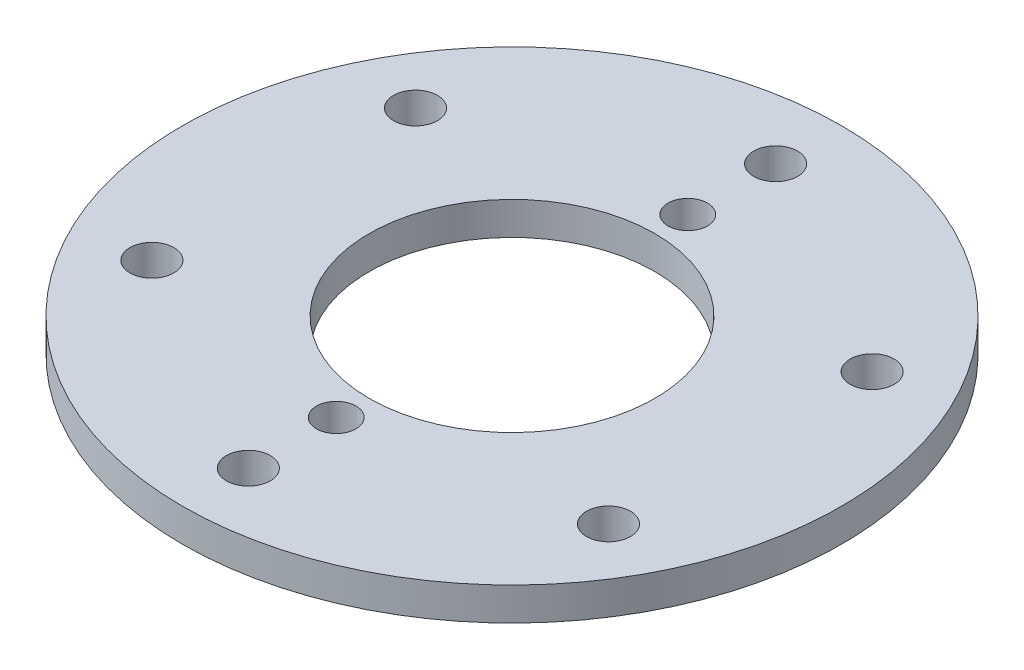
ISO-10303-21;
HEADER;
FILE_DESCRIPTION(('STEP AP214'),'2;1');
FILE_NAME('part.step','',(''),(''),'','','');
FILE_SCHEMA(('AUTOMOTIVE_DESIGN { 1 0 10303 214 1 1 1 1 }'));
ENDSEC;
DATA;
#1=APPLICATION_CONTEXT('core data for automotive mechanical design processes');
#2=APPLICATION_PROTOCOL_DEFINITION('international standard','automotive_design',2000,#1);
#3=PRODUCT_CONTEXT('',#1,'mechanical');
#4=PRODUCT('Part','Part','',(#3));
#5=PRODUCT_RELATED_PRODUCT_CATEGORY('part','',(#4));
#6=PRODUCT_DEFINITION_FORMATION('','',#4);
#7=PRODUCT_DEFINITION_CONTEXT('part definition',#1,'design');
#8=PRODUCT_DEFINITION('design','',#6,#7);
#9=PRODUCT_DEFINITION_SHAPE('','',#8);
#10=(LENGTH_UNIT() NAMED_UNIT(*) SI_UNIT(.MILLI.,.METRE.));
#11=(NAMED_UNIT(*) PLANE_ANGLE_UNIT() SI_UNIT($,.RADIAN.));
#12=(NAMED_UNIT(*) SI_UNIT($,.STERADIAN.) SOLID_ANGLE_UNIT());
#13=UNCERTAINTY_MEASURE_WITH_UNIT(LENGTH_MEASURE(1.E-05),#10,'distance_accuracy_value','');
#14=(GEOMETRIC_REPRESENTATION_CONTEXT(3) GLOBAL_UNCERTAINTY_ASSIGNED_CONTEXT((#13)) GLOBAL_UNIT_ASSIGNED_CONTEXT((#10,
#11,#12)) REPRESENTATION_CONTEXT('',''));
#15=CARTESIAN_POINT('',(0.,0.,0.));
#16=DIRECTION('',(0.,0.,1.));
#17=DIRECTION('',(1.,0.,0.));
#18=AXIS2_PLACEMENT_3D('',#15,#16,#17);
#19=CARTESIAN_POINT('',(0.,15.,0.));
#20=DIRECTION('',(0.,1.,0.));
#21=DIRECTION('',(0.,0.,1.));
#22=AXIS2_PLACEMENT_3D('',#19,#20,#21);
#23=PLANE('',#22);
#24=CARTESIAN_POINT('',(-103.923048454132,15.,-60.0000000000012));
#25=DIRECTION('',(0.,1.,0.));
#26=DIRECTION('',(0.,0.,1.));
#27=AXIS2_PLACEMENT_3D('',#24,#25,#26);
#28=CIRCLE('',#27,10.);
#29=CARTESIAN_POINT('',(-103.923048454132,15.,-50.0000000000012));
#30=VERTEX_POINT('',#29);
#31=EDGE_CURVE('E108',#30,#30,#28,.T.);
#32=ORIENTED_EDGE('',*,*,#31,.F.);
#33=EDGE_LOOP('',(#32));
#34=FACE_BOUND('',#33,.T.);
#35=CARTESIAN_POINT('',(-8.37955521322352E-13,15.,120.));
#36=DIRECTION('',(0.,1.,0.));
#37=DIRECTION('',(0.,0.,1.));
#38=AXIS2_PLACEMENT_3D('',#35,#36,#37);
#39=CIRCLE('',#38,10.);
#40=CARTESIAN_POINT('',(-8.37955521322352E-13,15.,130.));
#41=VERTEX_POINT('',#40);
#42=EDGE_CURVE('E92',#41,#41,#39,.T.);
#43=ORIENTED_EDGE('',*,*,#42,.F.);
#44=EDGE_LOOP('',(#43));
#45=FACE_BOUND('',#44,.T.);
#46=CARTESIAN_POINT('',(103.923048454133,15.,-59.9999999999998));
#47=DIRECTION('',(0.,1.,0.));
#48=DIRECTION('',(0.,0.,1.));
#49=AXIS2_PLACEMENT_3D('',#46,#47,#48);
#50=CIRCLE('',#49,9.99999999999999);
#51=CARTESIAN_POINT('',(103.923048454133,15.,-49.9999999999998));
#52=VERTEX_POINT('',#51);
#53=EDGE_CURVE('E76',#52,#52,#50,.T.);
#54=ORIENTED_EDGE('',*,*,#53,.F.);
#55=EDGE_LOOP('',(#54));
#56=FACE_BOUND('',#55,.T.);
#57=CARTESIAN_POINT('',(0.,15.,-120.));
#58=DIRECTION('',(0.,1.,0.));
#59=DIRECTION('',(0.,0.,1.));
#60=AXIS2_PLACEMENT_3D('',#57,#58,#59);
#61=CIRCLE('',#60,10.);
#62=CARTESIAN_POINT('',(0.,15.,-110.));
#63=VERTEX_POINT('',#62);
#64=EDGE_CURVE('E60',#63,#63,#61,.T.);
#65=ORIENTED_EDGE('',*,*,#64,.F.);
#66=EDGE_LOOP('',(#65));
#67=FACE_BOUND('',#66,.T.);
#68=CARTESIAN_POINT('',(0.,15.,0.));
#69=DIRECTION('',(0.,1.,0.));
#70=DIRECTION('',(0.,0.,1.));
#71=AXIS2_PLACEMENT_3D('',#68,#69,#70);
#72=CIRCLE('',#71,150.);
#73=CARTESIAN_POINT('',(0.,15.,150.));
#74=VERTEX_POINT('',#73);
#75=EDGE_CURVE('E10',#74,#74,#72,.T.);
#76=ORIENTED_EDGE('',*,*,#75,.T.);
#77=EDGE_LOOP('',(#76));
#78=FACE_BOUND('',#77,.T.);
#79=CARTESIAN_POINT('',(0.,15.,0.));
#80=DIRECTION('',(0.,1.,0.));
#81=DIRECTION('',(0.,0.,1.));
#82=AXIS2_PLACEMENT_3D('',#79,#80,#81);
#83=CIRCLE('',#82,65.);
#84=CARTESIAN_POINT('',(0.,15.,65.));
#85=VERTEX_POINT('',#84);
#86=EDGE_CURVE('E54',#85,#85,#83,.T.);
#87=ORIENTED_EDGE('',*,*,#86,.F.);
#88=EDGE_LOOP('',(#87));
#89=FACE_BOUND('',#88,.T.);
#90=CARTESIAN_POINT('',(0.,15.,-80.));
#91=DIRECTION('',(0.,1.,0.));
#92=DIRECTION('',(0.,0.,1.));
#93=AXIS2_PLACEMENT_3D('',#90,#91,#92);
#94=CIRCLE('',#93,9.);
#95=CARTESIAN_POINT('',(0.,15.,-71.));
#96=VERTEX_POINT('',#95);
#97=EDGE_CURVE('E68',#96,#96,#94,.T.);
#98=ORIENTED_EDGE('',*,*,#97,.F.);
#99=EDGE_LOOP('',(#98));
#100=FACE_BOUND('',#99,.T.);
#101=CARTESIAN_POINT('',(103.923048454132,15.,60.0000000000005));
#102=DIRECTION('',(0.,1.,0.));
#103=DIRECTION('',(0.,0.,1.));
#104=AXIS2_PLACEMENT_3D('',#101,#102,#103);
#105=CIRCLE('',#104,10.);
#106=CARTESIAN_POINT('',(103.923048454132,15.,70.0000000000005));
#107=VERTEX_POINT('',#106);
#108=EDGE_CURVE('E84',#107,#107,#105,.T.);
#109=ORIENTED_EDGE('',*,*,#108,.F.);
#110=EDGE_LOOP('',(#109));
#111=FACE_BOUND('',#110,.T.);
#112=CARTESIAN_POINT('',(-103.923048454133,15.,59.999999999999));
#113=DIRECTION('',(0.,1.,0.));
#114=DIRECTION('',(0.,0.,1.));
#115=AXIS2_PLACEMENT_3D('',#112,#113,#114);
#116=CIRCLE('',#115,9.99999999999999);
#117=CARTESIAN_POINT('',(-103.923048454133,15.,69.999999999999));
#118=VERTEX_POINT('',#117);
#119=EDGE_CURVE('E100',#118,#118,#116,.T.);
#120=ORIENTED_EDGE('',*,*,#119,.F.);
#121=EDGE_LOOP('',(#120));
#122=FACE_BOUND('',#121,.T.);
#123=CARTESIAN_POINT('',(-5.58637014214901E-13,15.,80.));
#124=DIRECTION('',(0.,1.,0.));
#125=DIRECTION('',(0.,0.,1.));
#126=AXIS2_PLACEMENT_3D('',#123,#124,#125);
#127=CIRCLE('',#126,9.);
#128=CARTESIAN_POINT('',(-5.58637014214901E-13,15.,89.));
#129=VERTEX_POINT('',#128);
#130=EDGE_CURVE('E116',#129,#129,#127,.T.);
#131=ORIENTED_EDGE('',*,*,#130,.F.);
#132=EDGE_LOOP('',(#131));
#133=FACE_BOUND('',#132,.T.);
#134=ADVANCED_FACE('F41',(#34,#45,#56,#67,#78,#89,#100,#111,#122,#133),#23,.T.);
#135=CARTESIAN_POINT('',(0.,0.,0.));
#136=DIRECTION('',(0.,1.,0.));
#137=DIRECTION('',(0.,0.,1.));
#138=AXIS2_PLACEMENT_3D('',#135,#136,#137);
#139=PLANE('',#138);
#140=CARTESIAN_POINT('',(0.,0.,0.));
#141=DIRECTION('',(0.,1.,0.));
#142=DIRECTION('',(0.,0.,1.));
#143=AXIS2_PLACEMENT_3D('',#140,#141,#142);
#144=CIRCLE('',#143,150.);
#145=CARTESIAN_POINT('',(0.,0.,150.));
#146=VERTEX_POINT('',#145);
#147=EDGE_CURVE('E45',#146,#146,#144,.T.);
#148=ORIENTED_EDGE('',*,*,#147,.F.);
#149=EDGE_LOOP('',(#148));
#150=FACE_BOUND('',#149,.T.);
#151=CARTESIAN_POINT('',(0.,0.,0.));
#152=DIRECTION('',(0.,1.,0.));
#153=DIRECTION('',(0.,0.,1.));
#154=AXIS2_PLACEMENT_3D('',#151,#152,#153);
#155=CIRCLE('',#154,65.);
#156=CARTESIAN_POINT('',(0.,0.,65.));
#157=VERTEX_POINT('',#156);
#158=EDGE_CURVE('E56',#157,#157,#155,.T.);
#159=ORIENTED_EDGE('',*,*,#158,.T.);
#160=EDGE_LOOP('',(#159));
#161=FACE_BOUND('',#160,.T.);
#162=CARTESIAN_POINT('',(0.,0.,-120.));
#163=DIRECTION('',(0.,1.,0.));
#164=DIRECTION('',(0.,0.,1.));
#165=AXIS2_PLACEMENT_3D('',#162,#163,#164);
#166=CIRCLE('',#165,10.);
#167=CARTESIAN_POINT('',(0.,0.,-110.));
#168=VERTEX_POINT('',#167);
#169=EDGE_CURVE('E64',#168,#168,#166,.T.);
#170=ORIENTED_EDGE('',*,*,#169,.T.);
#171=EDGE_LOOP('',(#170));
#172=FACE_BOUND('',#171,.T.);
#173=CARTESIAN_POINT('',(0.,0.,-80.));
#174=DIRECTION('',(0.,1.,0.));
#175=DIRECTION('',(0.,0.,1.));
#176=AXIS2_PLACEMENT_3D('',#173,#174,#175);
#177=CIRCLE('',#176,9.);
#178=CARTESIAN_POINT('',(0.,0.,-71.));
#179=VERTEX_POINT('',#178);
#180=EDGE_CURVE('E72',#179,#179,#177,.T.);
#181=ORIENTED_EDGE('',*,*,#180,.T.);
#182=EDGE_LOOP('',(#181));
#183=FACE_BOUND('',#182,.T.);
#184=CARTESIAN_POINT('',(103.923048454133,0.,-59.9999999999998));
#185=DIRECTION('',(0.,1.,0.));
#186=DIRECTION('',(0.,0.,1.));
#187=AXIS2_PLACEMENT_3D('',#184,#185,#186);
#188=CIRCLE('',#187,9.99999999999999);
#189=CARTESIAN_POINT('',(103.923048454133,0.,-49.9999999999998));
#190=VERTEX_POINT('',#189);
#191=EDGE_CURVE('E80',#190,#190,#188,.T.);
#192=ORIENTED_EDGE('',*,*,#191,.T.);
#193=EDGE_LOOP('',(#192));
#194=FACE_BOUND('',#193,.T.);
#195=CARTESIAN_POINT('',(103.923048454132,0.,60.0000000000005));
#196=DIRECTION('',(0.,1.,0.));
#197=DIRECTION('',(0.,0.,1.));
#198=AXIS2_PLACEMENT_3D('',#195,#196,#197);
#199=CIRCLE('',#198,10.);
#200=CARTESIAN_POINT('',(103.923048454132,0.,70.0000000000005));
#201=VERTEX_POINT('',#200);
#202=EDGE_CURVE('E88',#201,#201,#199,.T.);
#203=ORIENTED_EDGE('',*,*,#202,.T.);
#204=EDGE_LOOP('',(#203));
#205=FACE_BOUND('',#204,.T.);
#206=CARTESIAN_POINT('',(-8.37955521322352E-13,0.,120.));
#207=DIRECTION('',(0.,1.,0.));
#208=DIRECTION('',(0.,0.,1.));
#209=AXIS2_PLACEMENT_3D('',#206,#207,#208);
#210=CIRCLE('',#209,10.);
#211=CARTESIAN_POINT('',(-8.37955521322352E-13,0.,130.));
#212=VERTEX_POINT('',#211);
#213=EDGE_CURVE('E96',#212,#212,#210,.T.);
#214=ORIENTED_EDGE('',*,*,#213,.T.);
#215=EDGE_LOOP('',(#214));
#216=FACE_BOUND('',#215,.T.);
#217=CARTESIAN_POINT('',(-103.923048454133,0.,59.999999999999));
#218=DIRECTION('',(0.,1.,0.));
#219=DIRECTION('',(0.,0.,1.));
#220=AXIS2_PLACEMENT_3D('',#217,#218,#219);
#221=CIRCLE('',#220,9.99999999999999);
#222=CARTESIAN_POINT('',(-103.923048454133,0.,69.999999999999));
#223=VERTEX_POINT('',#222);
#224=EDGE_CURVE('E104',#223,#223,#221,.T.);
#225=ORIENTED_EDGE('',*,*,#224,.T.);
#226=EDGE_LOOP('',(#225));
#227=FACE_BOUND('',#226,.T.);
#228=CARTESIAN_POINT('',(-103.923048454132,0.,-60.0000000000012));
#229=DIRECTION('',(0.,1.,0.));
#230=DIRECTION('',(0.,0.,1.));
#231=AXIS2_PLACEMENT_3D('',#228,#229,#230);
#232=CIRCLE('',#231,10.);
#233=CARTESIAN_POINT('',(-103.923048454132,0.,-50.0000000000012));
#234=VERTEX_POINT('',#233);
#235=EDGE_CURVE('E112',#234,#234,#232,.T.);
#236=ORIENTED_EDGE('',*,*,#235,.T.);
#237=EDGE_LOOP('',(#236));
#238=FACE_BOUND('',#237,.T.);
#239=CARTESIAN_POINT('',(-5.58637014214901E-13,0.,80.));
#240=DIRECTION('',(0.,1.,0.));
#241=DIRECTION('',(0.,0.,1.));
#242=AXIS2_PLACEMENT_3D('',#239,#240,#241);
#243=CIRCLE('',#242,9.);
#244=CARTESIAN_POINT('',(-5.58637014214901E-13,0.,89.));
#245=VERTEX_POINT('',#244);
#246=EDGE_CURVE('E120',#245,#245,#243,.T.);
#247=ORIENTED_EDGE('',*,*,#246,.T.);
#248=EDGE_LOOP('',(#247));
#249=FACE_BOUND('',#248,.T.);
#250=ADVANCED_FACE('F132',(#150,#161,#172,#183,#194,#205,#216,#227,#238,#249),#139,.F.);
#251=CARTESIAN_POINT('',(0.,15.,0.));
#252=DIRECTION('',(0.,-1.,0.));
#253=DIRECTION('',(0.,0.,-1.));
#254=AXIS2_PLACEMENT_3D('',#251,#252,#253);
#255=CYLINDRICAL_SURFACE('',#254,150.);
#256=ORIENTED_EDGE('',*,*,#75,.F.);
#257=EDGE_LOOP('',(#256));
#258=FACE_BOUND('',#257,.T.);
#259=ORIENTED_EDGE('',*,*,#147,.T.);
#260=EDGE_LOOP('',(#259));
#261=FACE_BOUND('',#260,.T.);
#262=ADVANCED_FACE('F43',(#258,#261),#255,.T.);
#263=CARTESIAN_POINT('',(0.,15.,0.));
#264=DIRECTION('',(0.,-1.,0.));
#265=DIRECTION('',(0.,0.,-1.));
#266=AXIS2_PLACEMENT_3D('',#263,#264,#265);
#267=CYLINDRICAL_SURFACE('',#266,65.);
#268=ORIENTED_EDGE('',*,*,#86,.T.);
#269=EDGE_LOOP('',(#268));
#270=FACE_BOUND('',#269,.T.);
#271=ORIENTED_EDGE('',*,*,#158,.F.);
#272=EDGE_LOOP('',(#271));
#273=FACE_BOUND('',#272,.T.);
#274=ADVANCED_FACE('F142',(#270,#273),#267,.F.);
#275=CARTESIAN_POINT('',(0.,15.,-120.));
#276=DIRECTION('',(0.,-1.,0.));
#277=DIRECTION('',(0.,0.,-1.));
#278=AXIS2_PLACEMENT_3D('',#275,#276,#277);
#279=CYLINDRICAL_SURFACE('',#278,10.);
#280=ORIENTED_EDGE('',*,*,#64,.T.);
#281=EDGE_LOOP('',(#280));
#282=FACE_BOUND('',#281,.T.);
#283=ORIENTED_EDGE('',*,*,#169,.F.);
#284=EDGE_LOOP('',(#283));
#285=FACE_BOUND('',#284,.T.);
#286=ADVANCED_FACE('F145',(#282,#285),#279,.F.);
#287=CARTESIAN_POINT('',(0.,15.,-80.));
#288=DIRECTION('',(0.,-1.,0.));
#289=DIRECTION('',(0.,0.,-1.));
#290=AXIS2_PLACEMENT_3D('',#287,#288,#289);
#291=CYLINDRICAL_SURFACE('',#290,9.);
#292=ORIENTED_EDGE('',*,*,#97,.T.);
#293=EDGE_LOOP('',(#292));
#294=FACE_BOUND('',#293,.T.);
#295=ORIENTED_EDGE('',*,*,#180,.F.);
#296=EDGE_LOOP('',(#295));
#297=FACE_BOUND('',#296,.T.);
#298=ADVANCED_FACE('F149',(#294,#297),#291,.F.);
#299=CARTESIAN_POINT('',(103.923048454133,15.,-59.9999999999998));
#300=DIRECTION('',(0.,-1.,0.));
#301=DIRECTION('',(0.,0.,-1.));
#302=AXIS2_PLACEMENT_3D('',#299,#300,#301);
#303=CYLINDRICAL_SURFACE('',#302,9.99999999999999);
#304=ORIENTED_EDGE('',*,*,#53,.T.);
#305=EDGE_LOOP('',(#304));
#306=FACE_BOUND('',#305,.T.);
#307=ORIENTED_EDGE('',*,*,#191,.F.);
#308=EDGE_LOOP('',(#307));
#309=FACE_BOUND('',#308,.T.);
#310=ADVANCED_FACE('F153',(#306,#309),#303,.F.);
#311=CARTESIAN_POINT('',(103.923048454132,15.,60.0000000000005));
#312=DIRECTION('',(0.,-1.,0.));
#313=DIRECTION('',(0.,0.,-1.));
#314=AXIS2_PLACEMENT_3D('',#311,#312,#313);
#315=CYLINDRICAL_SURFACE('',#314,10.);
#316=ORIENTED_EDGE('',*,*,#108,.T.);
#317=EDGE_LOOP('',(#316));
#318=FACE_BOUND('',#317,.T.);
#319=ORIENTED_EDGE('',*,*,#202,.F.);
#320=EDGE_LOOP('',(#319));
#321=FACE_BOUND('',#320,.T.);
#322=ADVANCED_FACE('F157',(#318,#321),#315,.F.);
#323=CARTESIAN_POINT('',(-8.37955521322352E-13,15.,120.));
#324=DIRECTION('',(0.,-1.,0.));
#325=DIRECTION('',(0.,0.,-1.));
#326=AXIS2_PLACEMENT_3D('',#323,#324,#325);
#327=CYLINDRICAL_SURFACE('',#326,10.);
#328=ORIENTED_EDGE('',*,*,#42,.T.);
#329=EDGE_LOOP('',(#328));
#330=FACE_BOUND('',#329,.T.);
#331=ORIENTED_EDGE('',*,*,#213,.F.);
#332=EDGE_LOOP('',(#331));
#333=FACE_BOUND('',#332,.T.);
#334=ADVANCED_FACE('F161',(#330,#333),#327,.F.);
#335=CARTESIAN_POINT('',(-103.923048454133,15.,59.999999999999));
#336=DIRECTION('',(0.,-1.,0.));
#337=DIRECTION('',(0.,0.,-1.));
#338=AXIS2_PLACEMENT_3D('',#335,#336,#337);
#339=CYLINDRICAL_SURFACE('',#338,9.99999999999999);
#340=ORIENTED_EDGE('',*,*,#119,.T.);
#341=EDGE_LOOP('',(#340));
#342=FACE_BOUND('',#341,.T.);
#343=ORIENTED_EDGE('',*,*,#224,.F.);
#344=EDGE_LOOP('',(#343));
#345=FACE_BOUND('',#344,.T.);
#346=ADVANCED_FACE('F165',(#342,#345),#339,.F.);
#347=CARTESIAN_POINT('',(-103.923048454132,15.,-60.0000000000012));
#348=DIRECTION('',(0.,-1.,0.));
#349=DIRECTION('',(0.,0.,-1.));
#350=AXIS2_PLACEMENT_3D('',#347,#348,#349);
#351=CYLINDRICAL_SURFACE('',#350,10.);
#352=ORIENTED_EDGE('',*,*,#31,.T.);
#353=EDGE_LOOP('',(#352));
#354=FACE_BOUND('',#353,.T.);
#355=ORIENTED_EDGE('',*,*,#235,.F.);
#356=EDGE_LOOP('',(#355));
#357=FACE_BOUND('',#356,.T.);
#358=ADVANCED_FACE('F169',(#354,#357),#351,.F.);
#359=CARTESIAN_POINT('',(-5.58637014214901E-13,15.,80.));
#360=DIRECTION('',(0.,-1.,0.));
#361=DIRECTION('',(0.,0.,-1.));
#362=AXIS2_PLACEMENT_3D('',#359,#360,#361);
#363=CYLINDRICAL_SURFACE('',#362,9.);
#364=ORIENTED_EDGE('',*,*,#130,.T.);
#365=EDGE_LOOP('',(#364));
#366=FACE_BOUND('',#365,.T.);
#367=ORIENTED_EDGE('',*,*,#246,.F.);
#368=EDGE_LOOP('',(#367));
#369=FACE_BOUND('',#368,.T.);
#370=ADVANCED_FACE('F128',(#366,#369),#363,.F.);
#371=CLOSED_SHELL('',(#134,#250,#262,#274,#286,#298,#310,#322,#334,#346,#358,#370));
#372=MANIFOLD_SOLID_BREP('B2',#371);
#373=ADVANCED_BREP_SHAPE_REPRESENTATION('',(#18,#372),#14);
#374=SHAPE_DEFINITION_REPRESENTATION(#9,#373);
ENDSEC;
END-ISO-10303-21;
